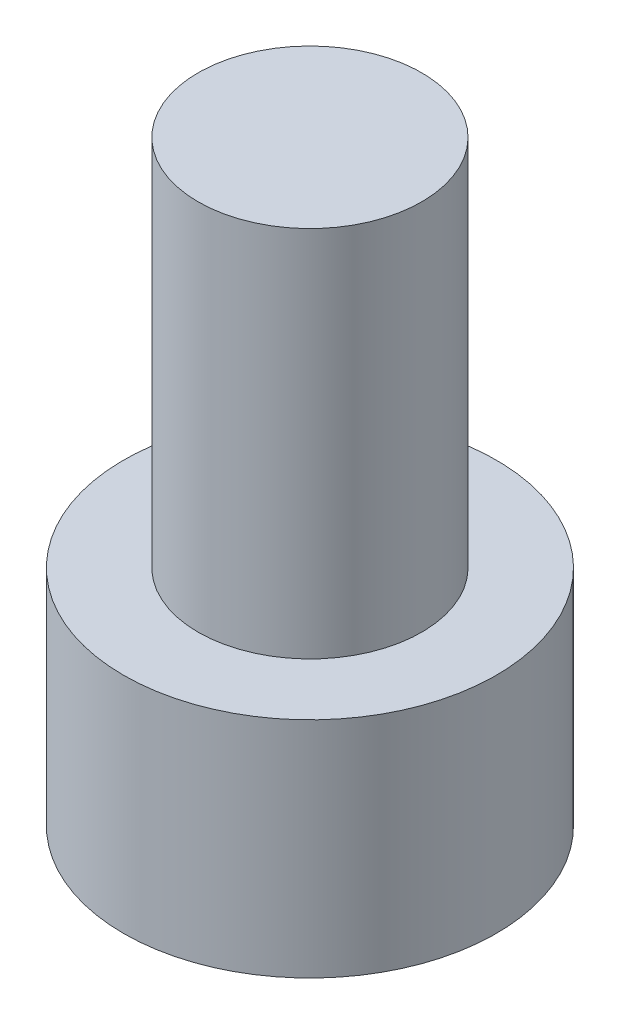
ISO-10303-21;
HEADER;
FILE_DESCRIPTION(('STEP AP214'),'2;1');
FILE_NAME('part.step','',(''),(''),'','','');
FILE_SCHEMA(('AUTOMOTIVE_DESIGN { 1 0 10303 214 1 1 1 1 }'));
ENDSEC;
DATA;
#1=APPLICATION_CONTEXT('core data for automotive mechanical design processes');
#2=APPLICATION_PROTOCOL_DEFINITION('international standard','automotive_design',2000,#1);
#3=PRODUCT_CONTEXT('',#1,'mechanical');
#4=PRODUCT('Part','Part','',(#3));
#5=PRODUCT_RELATED_PRODUCT_CATEGORY('part','',(#4));
#6=PRODUCT_DEFINITION_FORMATION('','',#4);
#7=PRODUCT_DEFINITION_CONTEXT('part definition',#1,'design');
#8=PRODUCT_DEFINITION('design','',#6,#7);
#9=PRODUCT_DEFINITION_SHAPE('','',#8);
#10=(LENGTH_UNIT() NAMED_UNIT(*) SI_UNIT(.MILLI.,.METRE.));
#11=(NAMED_UNIT(*) PLANE_ANGLE_UNIT() SI_UNIT($,.RADIAN.));
#12=(NAMED_UNIT(*) SI_UNIT($,.STERADIAN.) SOLID_ANGLE_UNIT());
#13=UNCERTAINTY_MEASURE_WITH_UNIT(LENGTH_MEASURE(1.E-05),#10,'distance_accuracy_value','');
#14=(GEOMETRIC_REPRESENTATION_CONTEXT(3) GLOBAL_UNCERTAINTY_ASSIGNED_CONTEXT((#13)) GLOBAL_UNIT_ASSIGNED_CONTEXT((#10,
#11,#12)) REPRESENTATION_CONTEXT('',''));
#15=CARTESIAN_POINT('',(0.,0.,0.));
#16=DIRECTION('',(0.,0.,1.));
#17=DIRECTION('',(1.,0.,0.));
#18=AXIS2_PLACEMENT_3D('',#15,#16,#17);
#19=CARTESIAN_POINT('',(0.,3.,0.));
#20=DIRECTION('',(0.,-1.,0.));
#21=DIRECTION('',(0.,0.,-1.));
#22=AXIS2_PLACEMENT_3D('',#19,#20,#21);
#23=CYLINDRICAL_SURFACE('',#22,2.5);
#24=CARTESIAN_POINT('',(0.,3.,0.));
#25=DIRECTION('',(0.,1.,0.));
#26=DIRECTION('',(0.,0.,1.));
#27=AXIS2_PLACEMENT_3D('',#24,#25,#26);
#28=CIRCLE('',#27,2.5);
#29=CARTESIAN_POINT('',(0.,3.,2.5));
#30=VERTEX_POINT('',#29);
#31=EDGE_CURVE('E43',#30,#30,#28,.T.);
#32=ORIENTED_EDGE('',*,*,#31,.F.);
#33=EDGE_LOOP('',(#32));
#34=FACE_BOUND('',#33,.T.);
#35=CARTESIAN_POINT('',(0.,0.,0.));
#36=DIRECTION('',(0.,1.,0.));
#37=DIRECTION('',(0.,0.,1.));
#38=AXIS2_PLACEMENT_3D('',#35,#36,#37);
#39=CIRCLE('',#38,2.5);
#40=CARTESIAN_POINT('',(0.,0.,2.5));
#41=VERTEX_POINT('',#40);
#42=EDGE_CURVE('E38',#41,#41,#39,.T.);
#43=ORIENTED_EDGE('',*,*,#42,.T.);
#44=EDGE_LOOP('',(#43));
#45=FACE_BOUND('',#44,.T.);
#46=ADVANCED_FACE('F35',(#34,#45),#23,.T.);
#47=CARTESIAN_POINT('',(0.,3.,0.));
#48=DIRECTION('',(0.,1.,0.));
#49=DIRECTION('',(0.,0.,1.));
#50=AXIS2_PLACEMENT_3D('',#47,#48,#49);
#51=PLANE('',#50);
#52=CARTESIAN_POINT('',(0.,3.,0.));
#53=DIRECTION('',(0.,1.,0.));
#54=DIRECTION('',(0.,0.,1.));
#55=AXIS2_PLACEMENT_3D('',#52,#53,#54);
#56=CIRCLE('',#55,1.5);
#57=CARTESIAN_POINT('',(0.,3.,1.5));
#58=VERTEX_POINT('',#57);
#59=EDGE_CURVE('E11',#58,#58,#56,.T.);
#60=ORIENTED_EDGE('',*,*,#59,.F.);
#61=EDGE_LOOP('',(#60));
#62=FACE_BOUND('',#61,.T.);
#63=ORIENTED_EDGE('',*,*,#31,.T.);
#64=EDGE_LOOP('',(#63));
#65=FACE_BOUND('',#64,.T.);
#66=ADVANCED_FACE('F155',(#62,#65),#51,.T.);
#67=CARTESIAN_POINT('',(0.,0.,0.));
#68=DIRECTION('',(0.,1.,0.));
#69=DIRECTION('',(0.,0.,1.));
#70=AXIS2_PLACEMENT_3D('',#67,#68,#69);
#71=PLANE('',#70);
#72=DIRECTION('',(-0.5,0.,0.866025403784439));
#73=VECTOR('',#72,1.);
#74=CARTESIAN_POINT('',(1.425,0.,0.));
#75=LINE('',#74,#73);
#76=CARTESIAN_POINT('',(1.425,0.,0.));
#77=VERTEX_POINT('',#76);
#78=CARTESIAN_POINT('',(0.7125,0.,1.23408620039283));
#79=VERTEX_POINT('',#78);
#80=EDGE_CURVE('E125',#77,#79,#75,.T.);
#81=ORIENTED_EDGE('',*,*,#80,.F.);
#82=DIRECTION('',(0.5,0.,0.866025403784439));
#83=VECTOR('',#82,1.);
#84=CARTESIAN_POINT('',(0.7125,0.,-1.23408620039283));
#85=LINE('',#84,#83);
#86=CARTESIAN_POINT('',(0.7125,0.,-1.23408620039283));
#87=VERTEX_POINT('',#86);
#88=EDGE_CURVE('E51',#87,#77,#85,.T.);
#89=ORIENTED_EDGE('',*,*,#88,.F.);
#90=DIRECTION('',(1.,0.,0.));
#91=VECTOR('',#90,1.);
#92=CARTESIAN_POINT('',(-0.7125,0.,-1.23408620039283));
#93=LINE('',#92,#91);
#94=CARTESIAN_POINT('',(-0.7125,0.,-1.23408620039283));
#95=VERTEX_POINT('',#94);
#96=EDGE_CURVE('E134',#95,#87,#93,.T.);
#97=ORIENTED_EDGE('',*,*,#96,.F.);
#98=DIRECTION('',(0.5,0.,-0.866025403784439));
#99=VECTOR('',#98,1.);
#100=CARTESIAN_POINT('',(-1.425,0.,0.));
#101=LINE('',#100,#99);
#102=CARTESIAN_POINT('',(-1.425,0.,0.));
#103=VERTEX_POINT('',#102);
#104=EDGE_CURVE('E132',#103,#95,#101,.T.);
#105=ORIENTED_EDGE('',*,*,#104,.F.);
#106=DIRECTION('',(-0.5,0.,-0.866025403784439));
#107=VECTOR('',#106,1.);
#108=CARTESIAN_POINT('',(-0.7125,0.,1.23408620039283));
#109=LINE('',#108,#107);
#110=CARTESIAN_POINT('',(-0.7125,0.,1.23408620039283));
#111=VERTEX_POINT('',#110);
#112=EDGE_CURVE('E99',#111,#103,#109,.T.);
#113=ORIENTED_EDGE('',*,*,#112,.F.);
#114=DIRECTION('',(-1.,0.,0.));
#115=VECTOR('',#114,1.);
#116=CARTESIAN_POINT('',(0.7125,0.,1.23408620039283));
#117=LINE('',#116,#115);
#118=EDGE_CURVE('E128',#79,#111,#117,.T.);
#119=ORIENTED_EDGE('',*,*,#118,.F.);
#120=EDGE_LOOP('',(#81,#89,#97,#105,#113,#119));
#121=FACE_BOUND('',#120,.T.);
#122=ORIENTED_EDGE('',*,*,#42,.F.);
#123=EDGE_LOOP('',(#122));
#124=FACE_BOUND('',#123,.T.);
#125=ADVANCED_FACE('F152',(#121,#124),#71,.F.);
#126=CARTESIAN_POINT('',(0.,8.,0.));
#127=DIRECTION('',(0.,-1.,0.));
#128=DIRECTION('',(0.,0.,-1.));
#129=AXIS2_PLACEMENT_3D('',#126,#127,#128);
#130=CYLINDRICAL_SURFACE('',#129,1.5);
#131=CARTESIAN_POINT('',(0.,8.,0.));
#132=DIRECTION('',(0.,1.,0.));
#133=DIRECTION('',(0.,0.,1.));
#134=AXIS2_PLACEMENT_3D('',#131,#132,#133);
#135=CIRCLE('',#134,1.5);
#136=CARTESIAN_POINT('',(0.,8.,1.5));
#137=VERTEX_POINT('',#136);
#138=EDGE_CURVE('E138',#137,#137,#135,.T.);
#139=ORIENTED_EDGE('',*,*,#138,.F.);
#140=EDGE_LOOP('',(#139));
#141=FACE_BOUND('',#140,.T.);
#142=ORIENTED_EDGE('',*,*,#59,.T.);
#143=EDGE_LOOP('',(#142));
#144=FACE_BOUND('',#143,.T.);
#145=ADVANCED_FACE('F154',(#141,#144),#130,.T.);
#146=CARTESIAN_POINT('',(0.,8.,0.));
#147=DIRECTION('',(0.,1.,0.));
#148=DIRECTION('',(0.,0.,1.));
#149=AXIS2_PLACEMENT_3D('',#146,#147,#148);
#150=PLANE('',#149);
#151=ORIENTED_EDGE('',*,*,#138,.T.);
#152=EDGE_LOOP('',(#151));
#153=FACE_BOUND('',#152,.T.);
#154=ADVANCED_FACE('F162',(#153),#150,.T.);
#155=CARTESIAN_POINT('',(0.7125,1.65,-1.23408620039283));
#156=DIRECTION('',(0.866025403784439,0.,-0.5));
#157=DIRECTION('',(-0.5,0.,-0.866025403784439));
#158=AXIS2_PLACEMENT_3D('',#155,#156,#157);
#159=PLANE('',#158);
#160=ORIENTED_EDGE('',*,*,#88,.T.);
#161=DIRECTION('',(0.,-1.,0.));
#162=VECTOR('',#161,1.);
#163=CARTESIAN_POINT('',(1.425,1.65,0.));
#164=LINE('',#163,#162);
#165=CARTESIAN_POINT('',(1.425,1.65,0.));
#166=VERTEX_POINT('',#165);
#167=EDGE_CURVE('E81',#166,#77,#164,.T.);
#168=ORIENTED_EDGE('',*,*,#167,.F.);
#169=DIRECTION('',(0.5,0.,0.866025403784439));
#170=VECTOR('',#169,1.);
#171=CARTESIAN_POINT('',(0.7125,1.65,-1.23408620039283));
#172=LINE('',#171,#170);
#173=CARTESIAN_POINT('',(0.7125,1.65,-1.23408620039283));
#174=VERTEX_POINT('',#173);
#175=EDGE_CURVE('E136',#174,#166,#172,.T.);
#176=ORIENTED_EDGE('',*,*,#175,.F.);
#177=DIRECTION('',(0.,-1.,0.));
#178=VECTOR('',#177,1.);
#179=CARTESIAN_POINT('',(0.7125,1.65,-1.23408620039283));
#180=LINE('',#179,#178);
#181=EDGE_CURVE('E59',#174,#87,#180,.T.);
#182=ORIENTED_EDGE('',*,*,#181,.T.);
#183=EDGE_LOOP('',(#160,#168,#176,#182));
#184=FACE_BOUND('',#183,.T.);
#185=ADVANCED_FACE('F190',(#184),#159,.F.);
#186=CARTESIAN_POINT('',(-0.7125,1.65,-1.23408620039283));
#187=DIRECTION('',(0.,0.,-1.));
#188=DIRECTION('',(-1.,0.,0.));
#189=AXIS2_PLACEMENT_3D('',#186,#187,#188);
#190=PLANE('',#189);
#191=ORIENTED_EDGE('',*,*,#96,.T.);
#192=ORIENTED_EDGE('',*,*,#181,.F.);
#193=DIRECTION('',(1.,0.,0.));
#194=VECTOR('',#193,1.);
#195=CARTESIAN_POINT('',(-0.7125,1.65,-1.23408620039283));
#196=LINE('',#195,#194);
#197=CARTESIAN_POINT('',(-0.7125,1.65,-1.23408620039283));
#198=VERTEX_POINT('',#197);
#199=EDGE_CURVE('E111',#198,#174,#196,.T.);
#200=ORIENTED_EDGE('',*,*,#199,.F.);
#201=DIRECTION('',(0.,-1.,0.));
#202=VECTOR('',#201,1.);
#203=CARTESIAN_POINT('',(-0.7125,1.65,-1.23408620039283));
#204=LINE('',#203,#202);
#205=EDGE_CURVE('E103',#198,#95,#204,.T.);
#206=ORIENTED_EDGE('',*,*,#205,.T.);
#207=EDGE_LOOP('',(#191,#192,#200,#206));
#208=FACE_BOUND('',#207,.T.);
#209=ADVANCED_FACE('F197',(#208),#190,.F.);
#210=CARTESIAN_POINT('',(-1.425,1.65,0.));
#211=DIRECTION('',(-0.866025403784439,0.,-0.5));
#212=DIRECTION('',(-0.5,0.,0.866025403784439));
#213=AXIS2_PLACEMENT_3D('',#210,#211,#212);
#214=PLANE('',#213);
#215=ORIENTED_EDGE('',*,*,#104,.T.);
#216=ORIENTED_EDGE('',*,*,#205,.F.);
#217=DIRECTION('',(0.5,0.,-0.866025403784439));
#218=VECTOR('',#217,1.);
#219=CARTESIAN_POINT('',(-1.425,1.65,0.));
#220=LINE('',#219,#218);
#221=CARTESIAN_POINT('',(-1.425,1.65,0.));
#222=VERTEX_POINT('',#221);
#223=EDGE_CURVE('E107',#222,#198,#220,.T.);
#224=ORIENTED_EDGE('',*,*,#223,.F.);
#225=DIRECTION('',(0.,-1.,0.));
#226=VECTOR('',#225,1.);
#227=CARTESIAN_POINT('',(-1.425,1.65,0.));
#228=LINE('',#227,#226);
#229=EDGE_CURVE('E92',#222,#103,#228,.T.);
#230=ORIENTED_EDGE('',*,*,#229,.T.);
#231=EDGE_LOOP('',(#215,#216,#224,#230));
#232=FACE_BOUND('',#231,.T.);
#233=ADVANCED_FACE('F108',(#232),#214,.F.);
#234=CARTESIAN_POINT('',(-0.7125,1.65,1.23408620039283));
#235=DIRECTION('',(-0.866025403784439,0.,0.5));
#236=DIRECTION('',(0.5,0.,0.866025403784439));
#237=AXIS2_PLACEMENT_3D('',#234,#235,#236);
#238=PLANE('',#237);
#239=ORIENTED_EDGE('',*,*,#112,.T.);
#240=ORIENTED_EDGE('',*,*,#229,.F.);
#241=DIRECTION('',(-0.5,0.,-0.866025403784439));
#242=VECTOR('',#241,1.);
#243=CARTESIAN_POINT('',(-0.7125,1.65,1.23408620039283));
#244=LINE('',#243,#242);
#245=CARTESIAN_POINT('',(-0.7125,1.65,1.23408620039283));
#246=VERTEX_POINT('',#245);
#247=EDGE_CURVE('E96',#246,#222,#244,.T.);
#248=ORIENTED_EDGE('',*,*,#247,.F.);
#249=DIRECTION('',(0.,-1.,0.));
#250=VECTOR('',#249,1.);
#251=CARTESIAN_POINT('',(-0.7125,1.65,1.23408620039283));
#252=LINE('',#251,#250);
#253=EDGE_CURVE('E104',#246,#111,#252,.T.);
#254=ORIENTED_EDGE('',*,*,#253,.T.);
#255=EDGE_LOOP('',(#239,#240,#248,#254));
#256=FACE_BOUND('',#255,.T.);
#257=ADVANCED_FACE('F94',(#256),#238,.F.);
#258=CARTESIAN_POINT('',(0.7125,1.65,1.23408620039283));
#259=DIRECTION('',(0.,0.,1.));
#260=DIRECTION('',(1.,0.,0.));
#261=AXIS2_PLACEMENT_3D('',#258,#259,#260);
#262=PLANE('',#261);
#263=ORIENTED_EDGE('',*,*,#118,.T.);
#264=ORIENTED_EDGE('',*,*,#253,.F.);
#265=DIRECTION('',(-1.,0.,0.));
#266=VECTOR('',#265,1.);
#267=CARTESIAN_POINT('',(0.7125,1.65,1.23408620039283));
#268=LINE('',#267,#266);
#269=CARTESIAN_POINT('',(0.7125,1.65,1.23408620039283));
#270=VERTEX_POINT('',#269);
#271=EDGE_CURVE('E117',#270,#246,#268,.T.);
#272=ORIENTED_EDGE('',*,*,#271,.F.);
#273=DIRECTION('',(0.,-1.,0.));
#274=VECTOR('',#273,1.);
#275=CARTESIAN_POINT('',(0.7125,1.65,1.23408620039283));
#276=LINE('',#275,#274);
#277=EDGE_CURVE('E141',#270,#79,#276,.T.);
#278=ORIENTED_EDGE('',*,*,#277,.T.);
#279=EDGE_LOOP('',(#263,#264,#272,#278));
#280=FACE_BOUND('',#279,.T.);
#281=ADVANCED_FACE('F216',(#280),#262,.F.);
#282=CARTESIAN_POINT('',(1.425,1.65,0.));
#283=DIRECTION('',(0.866025403784439,0.,0.5));
#284=DIRECTION('',(0.5,0.,-0.866025403784438));
#285=AXIS2_PLACEMENT_3D('',#282,#283,#284);
#286=PLANE('',#285);
#287=ORIENTED_EDGE('',*,*,#80,.T.);
#288=ORIENTED_EDGE('',*,*,#277,.F.);
#289=DIRECTION('',(-0.5,0.,0.866025403784439));
#290=VECTOR('',#289,1.);
#291=CARTESIAN_POINT('',(1.425,1.65,0.));
#292=LINE('',#291,#290);
#293=EDGE_CURVE('E119',#166,#270,#292,.T.);
#294=ORIENTED_EDGE('',*,*,#293,.F.);
#295=ORIENTED_EDGE('',*,*,#167,.T.);
#296=EDGE_LOOP('',(#287,#288,#294,#295));
#297=FACE_BOUND('',#296,.T.);
#298=ADVANCED_FACE('F223',(#297),#286,.F.);
#299=CARTESIAN_POINT('',(0.,1.65,0.));
#300=DIRECTION('',(0.,-1.,0.));
#301=DIRECTION('',(0.,0.,-1.));
#302=AXIS2_PLACEMENT_3D('',#299,#300,#301);
#303=PLANE('',#302);
#304=ORIENTED_EDGE('',*,*,#175,.T.);
#305=ORIENTED_EDGE('',*,*,#293,.T.);
#306=ORIENTED_EDGE('',*,*,#271,.T.);
#307=ORIENTED_EDGE('',*,*,#247,.T.);
#308=ORIENTED_EDGE('',*,*,#223,.T.);
#309=ORIENTED_EDGE('',*,*,#199,.T.);
#310=EDGE_LOOP('',(#304,#305,#306,#307,#308,#309));
#311=FACE_BOUND('',#310,.T.);
#312=ADVANCED_FACE('F114',(#311),#303,.T.);
#313=CLOSED_SHELL('',(#46,#66,#125,#145,#154,#185,#209,#233,#257,#281,#298,#312));
#314=MANIFOLD_SOLID_BREP('B2',#313);
#315=ADVANCED_BREP_SHAPE_REPRESENTATION('',(#18,#314),#14);
#316=SHAPE_DEFINITION_REPRESENTATION(#9,#315);
ENDSEC;
END-ISO-10303-21;
